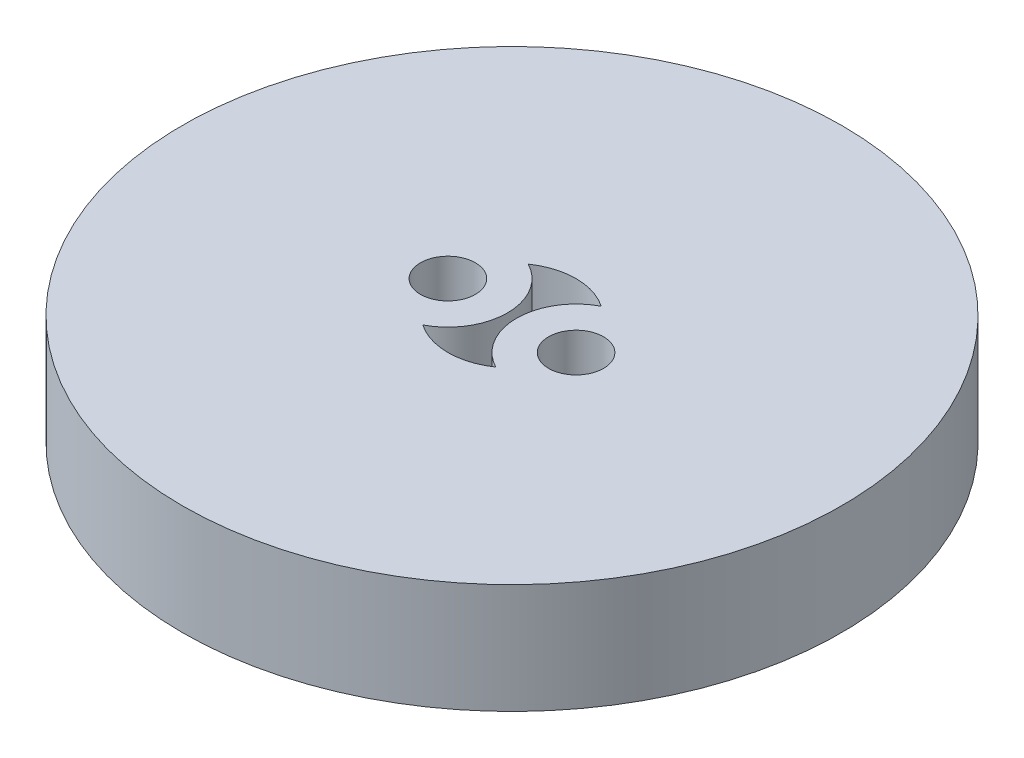
ISO-10303-21;
HEADER;
FILE_DESCRIPTION(('STEP AP214'),'2;1');
FILE_NAME('part.step','',(''),(''),'','','');
FILE_SCHEMA(('AUTOMOTIVE_DESIGN { 1 0 10303 214 1 1 1 1 }'));
ENDSEC;
DATA;
#1=APPLICATION_CONTEXT('core data for automotive mechanical design processes');
#2=APPLICATION_PROTOCOL_DEFINITION('international standard','automotive_design',2000,#1);
#3=PRODUCT_CONTEXT('',#1,'mechanical');
#4=PRODUCT('Part','Part','',(#3));
#5=PRODUCT_RELATED_PRODUCT_CATEGORY('part','',(#4));
#6=PRODUCT_DEFINITION_FORMATION('','',#4);
#7=PRODUCT_DEFINITION_CONTEXT('part definition',#1,'design');
#8=PRODUCT_DEFINITION('design','',#6,#7);
#9=PRODUCT_DEFINITION_SHAPE('','',#8);
#10=(LENGTH_UNIT() NAMED_UNIT(*) SI_UNIT(.MILLI.,.METRE.));
#11=(NAMED_UNIT(*) PLANE_ANGLE_UNIT() SI_UNIT($,.RADIAN.));
#12=(NAMED_UNIT(*) SI_UNIT($,.STERADIAN.) SOLID_ANGLE_UNIT());
#13=UNCERTAINTY_MEASURE_WITH_UNIT(LENGTH_MEASURE(1.E-05),#10,'distance_accuracy_value','');
#14=(GEOMETRIC_REPRESENTATION_CONTEXT(3) GLOBAL_UNCERTAINTY_ASSIGNED_CONTEXT((#13)) GLOBAL_UNIT_ASSIGNED_CONTEXT((#10,
#11,#12)) REPRESENTATION_CONTEXT('',''));
#15=CARTESIAN_POINT('',(0.,0.,0.));
#16=DIRECTION('',(0.,0.,1.));
#17=DIRECTION('',(1.,0.,0.));
#18=AXIS2_PLACEMENT_3D('',#15,#16,#17);
#19=CARTESIAN_POINT('',(0.,6.,0.));
#20=DIRECTION('',(0.,1.,0.));
#21=DIRECTION('',(0.,0.,1.));
#22=AXIS2_PLACEMENT_3D('',#19,#20,#21);
#23=PLANE('',#22);
#24=CARTESIAN_POINT('',(-3.5,6.,0.));
#25=DIRECTION('',(0.,1.,0.));
#26=DIRECTION('',(0.,0.,1.));
#27=AXIS2_PLACEMENT_3D('',#24,#25,#26);
#28=CIRCLE('',#27,1.5);
#29=CARTESIAN_POINT('',(-3.5,6.,1.5));
#30=VERTEX_POINT('',#29);
#31=EDGE_CURVE('E116',#30,#30,#28,.T.);
#32=ORIENTED_EDGE('',*,*,#31,.F.);
#33=EDGE_LOOP('',(#32));
#34=FACE_BOUND('',#33,.T.);
#35=CARTESIAN_POINT('',(0.,6.,0.));
#36=DIRECTION('',(0.,1.,0.));
#37=DIRECTION('',(0.,0.,1.));
#38=AXIS2_PLACEMENT_3D('',#35,#36,#37);
#39=CIRCLE('',#38,18.);
#40=CARTESIAN_POINT('',(0.,6.,18.));
#41=VERTEX_POINT('',#40);
#42=EDGE_CURVE('E11',#41,#41,#39,.T.);
#43=ORIENTED_EDGE('',*,*,#42,.T.);
#44=EDGE_LOOP('',(#43));
#45=FACE_BOUND('',#44,.T.);
#46=CARTESIAN_POINT('',(3.5,6.,0.));
#47=DIRECTION('',(0.,1.,0.));
#48=DIRECTION('',(0.,0.,1.));
#49=AXIS2_PLACEMENT_3D('',#46,#47,#48);
#50=CIRCLE('',#49,1.5);
#51=CARTESIAN_POINT('',(3.5,6.,1.5));
#52=VERTEX_POINT('',#51);
#53=EDGE_CURVE('E110',#52,#52,#50,.T.);
#54=ORIENTED_EDGE('',*,*,#53,.F.);
#55=EDGE_LOOP('',(#54));
#56=FACE_BOUND('',#55,.T.);
#57=CARTESIAN_POINT('',(-3.5,6.,0.));
#58=DIRECTION('',(0.,-1.,0.));
#59=DIRECTION('',(0.,0.,1.));
#60=AXIS2_PLACEMENT_3D('',#57,#58,#59);
#61=CIRCLE('',#60,3.25);
#62=CARTESIAN_POINT('',(-1.99107142857143,6.,-2.87847782105865));
#63=VERTEX_POINT('',#62);
#64=CARTESIAN_POINT('',(-1.99107142857143,6.,2.87847782105865));
#65=VERTEX_POINT('',#64);
#66=EDGE_CURVE('E82',#63,#65,#61,.T.);
#67=ORIENTED_EDGE('',*,*,#66,.F.);
#68=CARTESIAN_POINT('',(0.,6.,0.));
#69=DIRECTION('',(0.,1.,0.));
#70=DIRECTION('',(0.,0.,1.));
#71=AXIS2_PLACEMENT_3D('',#68,#69,#70);
#72=CIRCLE('',#71,3.5);
#73=CARTESIAN_POINT('',(1.99107142857143,6.,-2.87847782105865));
#74=VERTEX_POINT('',#73);
#75=EDGE_CURVE('E74',#74,#63,#72,.T.);
#76=ORIENTED_EDGE('',*,*,#75,.F.);
#77=CARTESIAN_POINT('',(3.5,6.,0.));
#78=DIRECTION('',(0.,-1.,0.));
#79=DIRECTION('',(0.,0.,1.));
#80=AXIS2_PLACEMENT_3D('',#77,#78,#79);
#81=CIRCLE('',#80,3.25);
#82=CARTESIAN_POINT('',(1.99107142857143,6.,2.87847782105865));
#83=VERTEX_POINT('',#82);
#84=EDGE_CURVE('E96',#83,#74,#81,.T.);
#85=ORIENTED_EDGE('',*,*,#84,.F.);
#86=CARTESIAN_POINT('',(0.,6.,0.));
#87=DIRECTION('',(0.,1.,0.));
#88=DIRECTION('',(0.,0.,1.));
#89=AXIS2_PLACEMENT_3D('',#86,#87,#88);
#90=CIRCLE('',#89,3.5);
#91=EDGE_CURVE('E94',#65,#83,#90,.T.);
#92=ORIENTED_EDGE('',*,*,#91,.F.);
#93=EDGE_LOOP('',(#67,#76,#85,#92));
#94=FACE_BOUND('',#93,.T.);
#95=ADVANCED_FACE('F33',(#34,#45,#56,#94),#23,.T.);
#96=CARTESIAN_POINT('',(0.,0.,0.));
#97=DIRECTION('',(0.,1.,0.));
#98=DIRECTION('',(0.,0.,1.));
#99=AXIS2_PLACEMENT_3D('',#96,#97,#98);
#100=PLANE('',#99);
#101=CARTESIAN_POINT('',(3.5,0.,0.));
#102=DIRECTION('',(0.,1.,0.));
#103=DIRECTION('',(0.,0.,1.));
#104=AXIS2_PLACEMENT_3D('',#101,#102,#103);
#105=CIRCLE('',#104,1.5);
#106=CARTESIAN_POINT('',(3.5,0.,1.5));
#107=VERTEX_POINT('',#106);
#108=EDGE_CURVE('E90',#107,#107,#105,.T.);
#109=ORIENTED_EDGE('',*,*,#108,.T.);
#110=EDGE_LOOP('',(#109));
#111=FACE_BOUND('',#110,.T.);
#112=CARTESIAN_POINT('',(-3.5,0.,0.));
#113=DIRECTION('',(0.,1.,0.));
#114=DIRECTION('',(0.,0.,1.));
#115=AXIS2_PLACEMENT_3D('',#112,#113,#114);
#116=CIRCLE('',#115,1.5);
#117=CARTESIAN_POINT('',(-3.5,0.,1.5));
#118=VERTEX_POINT('',#117);
#119=EDGE_CURVE('E113',#118,#118,#116,.T.);
#120=ORIENTED_EDGE('',*,*,#119,.T.);
#121=EDGE_LOOP('',(#120));
#122=FACE_BOUND('',#121,.T.);
#123=CARTESIAN_POINT('',(0.,0.,0.));
#124=DIRECTION('',(0.,1.,0.));
#125=DIRECTION('',(0.,0.,1.));
#126=AXIS2_PLACEMENT_3D('',#123,#124,#125);
#127=CIRCLE('',#126,18.);
#128=CARTESIAN_POINT('',(0.,0.,18.));
#129=VERTEX_POINT('',#128);
#130=EDGE_CURVE('E37',#129,#129,#127,.T.);
#131=ORIENTED_EDGE('',*,*,#130,.F.);
#132=EDGE_LOOP('',(#131));
#133=FACE_BOUND('',#132,.T.);
#134=CARTESIAN_POINT('',(0.,0.,0.));
#135=DIRECTION('',(0.,1.,0.));
#136=DIRECTION('',(0.,0.,1.));
#137=AXIS2_PLACEMENT_3D('',#134,#135,#136);
#138=CIRCLE('',#137,3.5);
#139=CARTESIAN_POINT('',(1.99107142857143,0.,-2.87847782105865));
#140=VERTEX_POINT('',#139);
#141=CARTESIAN_POINT('',(-1.99107142857143,0.,-2.87847782105865));
#142=VERTEX_POINT('',#141);
#143=EDGE_CURVE('E56',#140,#142,#138,.T.);
#144=ORIENTED_EDGE('',*,*,#143,.T.);
#145=CARTESIAN_POINT('',(-3.5,0.,0.));
#146=DIRECTION('',(0.,-1.,0.));
#147=DIRECTION('',(0.,0.,1.));
#148=AXIS2_PLACEMENT_3D('',#145,#146,#147);
#149=CIRCLE('',#148,3.25);
#150=CARTESIAN_POINT('',(-1.99107142857143,0.,2.87847782105865));
#151=VERTEX_POINT('',#150);
#152=EDGE_CURVE('E89',#142,#151,#149,.T.);
#153=ORIENTED_EDGE('',*,*,#152,.T.);
#154=CARTESIAN_POINT('',(0.,0.,0.));
#155=DIRECTION('',(0.,1.,0.));
#156=DIRECTION('',(0.,0.,1.));
#157=AXIS2_PLACEMENT_3D('',#154,#155,#156);
#158=CIRCLE('',#157,3.5);
#159=CARTESIAN_POINT('',(1.99107142857143,0.,2.87847782105865));
#160=VERTEX_POINT('',#159);
#161=EDGE_CURVE('E102',#151,#160,#158,.T.);
#162=ORIENTED_EDGE('',*,*,#161,.T.);
#163=CARTESIAN_POINT('',(3.5,0.,0.));
#164=DIRECTION('',(0.,-1.,0.));
#165=DIRECTION('',(0.,0.,1.));
#166=AXIS2_PLACEMENT_3D('',#163,#164,#165);
#167=CIRCLE('',#166,3.25);
#168=EDGE_CURVE('E83',#160,#140,#167,.T.);
#169=ORIENTED_EDGE('',*,*,#168,.T.);
#170=EDGE_LOOP('',(#144,#153,#162,#169));
#171=FACE_BOUND('',#170,.T.);
#172=ADVANCED_FACE('F122',(#111,#122,#133,#171),#100,.F.);
#173=CARTESIAN_POINT('',(0.,6.,0.));
#174=DIRECTION('',(0.,-1.,0.));
#175=DIRECTION('',(0.,0.,-1.));
#176=AXIS2_PLACEMENT_3D('',#173,#174,#175);
#177=CYLINDRICAL_SURFACE('',#176,18.);
#178=ORIENTED_EDGE('',*,*,#42,.F.);
#179=EDGE_LOOP('',(#178));
#180=FACE_BOUND('',#179,.T.);
#181=ORIENTED_EDGE('',*,*,#130,.T.);
#182=EDGE_LOOP('',(#181));
#183=FACE_BOUND('',#182,.T.);
#184=ADVANCED_FACE('F35',(#180,#183),#177,.T.);
#185=CARTESIAN_POINT('',(-3.5,6.,0.));
#186=DIRECTION('',(0.,-1.,0.));
#187=DIRECTION('',(0.,0.,-1.));
#188=AXIS2_PLACEMENT_3D('',#185,#186,#187);
#189=CYLINDRICAL_SURFACE('',#188,1.5);
#190=ORIENTED_EDGE('',*,*,#31,.T.);
#191=EDGE_LOOP('',(#190));
#192=FACE_BOUND('',#191,.T.);
#193=ORIENTED_EDGE('',*,*,#119,.F.);
#194=EDGE_LOOP('',(#193));
#195=FACE_BOUND('',#194,.T.);
#196=ADVANCED_FACE('F125',(#192,#195),#189,.F.);
#197=CARTESIAN_POINT('',(3.5,6.,0.));
#198=DIRECTION('',(0.,-1.,0.));
#199=DIRECTION('',(0.,0.,-1.));
#200=AXIS2_PLACEMENT_3D('',#197,#198,#199);
#201=CYLINDRICAL_SURFACE('',#200,1.5);
#202=ORIENTED_EDGE('',*,*,#53,.T.);
#203=EDGE_LOOP('',(#202));
#204=FACE_BOUND('',#203,.T.);
#205=ORIENTED_EDGE('',*,*,#108,.F.);
#206=EDGE_LOOP('',(#205));
#207=FACE_BOUND('',#206,.T.);
#208=ADVANCED_FACE('F127',(#204,#207),#201,.F.);
#209=CARTESIAN_POINT('',(0.,6.,0.));
#210=DIRECTION('',(0.,-1.,0.));
#211=DIRECTION('',(0.,0.,-1.));
#212=AXIS2_PLACEMENT_3D('',#209,#210,#211);
#213=CYLINDRICAL_SURFACE('',#212,3.5);
#214=ORIENTED_EDGE('',*,*,#143,.F.);
#215=DIRECTION('',(0.,-1.,0.));
#216=VECTOR('',#215,1.);
#217=CARTESIAN_POINT('',(1.99107142857143,6.,-2.87847782105865));
#218=LINE('',#217,#216);
#219=EDGE_CURVE('E78',#74,#140,#218,.T.);
#220=ORIENTED_EDGE('',*,*,#219,.F.);
#221=ORIENTED_EDGE('',*,*,#75,.T.);
#222=DIRECTION('',(0.,-1.,0.));
#223=VECTOR('',#222,1.);
#224=CARTESIAN_POINT('',(-1.99107142857143,6.,-2.87847782105865));
#225=LINE('',#224,#223);
#226=EDGE_CURVE('E77',#63,#142,#225,.T.);
#227=ORIENTED_EDGE('',*,*,#226,.T.);
#228=EDGE_LOOP('',(#214,#220,#221,#227));
#229=FACE_BOUND('',#228,.T.);
#230=ADVANCED_FACE('F76',(#229),#213,.F.);
#231=CARTESIAN_POINT('',(-3.5,6.,0.));
#232=DIRECTION('',(0.,-1.,0.));
#233=DIRECTION('',(0.,0.,-1.));
#234=AXIS2_PLACEMENT_3D('',#231,#232,#233);
#235=CYLINDRICAL_SURFACE('',#234,3.25);
#236=ORIENTED_EDGE('',*,*,#152,.F.);
#237=ORIENTED_EDGE('',*,*,#226,.F.);
#238=ORIENTED_EDGE('',*,*,#66,.T.);
#239=DIRECTION('',(0.,-1.,0.));
#240=VECTOR('',#239,1.);
#241=CARTESIAN_POINT('',(-1.99107142857143,6.,2.87847782105865));
#242=LINE('',#241,#240);
#243=EDGE_CURVE('E91',#65,#151,#242,.T.);
#244=ORIENTED_EDGE('',*,*,#243,.T.);
#245=EDGE_LOOP('',(#236,#237,#238,#244));
#246=FACE_BOUND('',#245,.T.);
#247=ADVANCED_FACE('F86',(#246),#235,.T.);
#248=CARTESIAN_POINT('',(0.,6.,0.));
#249=DIRECTION('',(0.,-1.,0.));
#250=DIRECTION('',(0.,0.,-1.));
#251=AXIS2_PLACEMENT_3D('',#248,#249,#250);
#252=CYLINDRICAL_SURFACE('',#251,3.5);
#253=ORIENTED_EDGE('',*,*,#161,.F.);
#254=ORIENTED_EDGE('',*,*,#243,.F.);
#255=ORIENTED_EDGE('',*,*,#91,.T.);
#256=DIRECTION('',(0.,-1.,0.));
#257=VECTOR('',#256,1.);
#258=CARTESIAN_POINT('',(1.99107142857143,6.,2.87847782105865));
#259=LINE('',#258,#257);
#260=EDGE_CURVE('E48',#83,#160,#259,.T.);
#261=ORIENTED_EDGE('',*,*,#260,.T.);
#262=EDGE_LOOP('',(#253,#254,#255,#261));
#263=FACE_BOUND('',#262,.T.);
#264=ADVANCED_FACE('F158',(#263),#252,.F.);
#265=CARTESIAN_POINT('',(3.5,6.,0.));
#266=DIRECTION('',(0.,-1.,0.));
#267=DIRECTION('',(0.,0.,-1.));
#268=AXIS2_PLACEMENT_3D('',#265,#266,#267);
#269=CYLINDRICAL_SURFACE('',#268,3.25);
#270=ORIENTED_EDGE('',*,*,#168,.F.);
#271=ORIENTED_EDGE('',*,*,#260,.F.);
#272=ORIENTED_EDGE('',*,*,#84,.T.);
#273=ORIENTED_EDGE('',*,*,#219,.T.);
#274=EDGE_LOOP('',(#270,#271,#272,#273));
#275=FACE_BOUND('',#274,.T.);
#276=ADVANCED_FACE('F156',(#275),#269,.T.);
#277=CLOSED_SHELL('',(#95,#172,#184,#196,#208,#230,#247,#264,#276));
#278=MANIFOLD_SOLID_BREP('B2',#277);
#279=ADVANCED_BREP_SHAPE_REPRESENTATION('',(#18,#278),#14);
#280=SHAPE_DEFINITION_REPRESENTATION(#9,#279);
ENDSEC;
END-ISO-10303-21;
